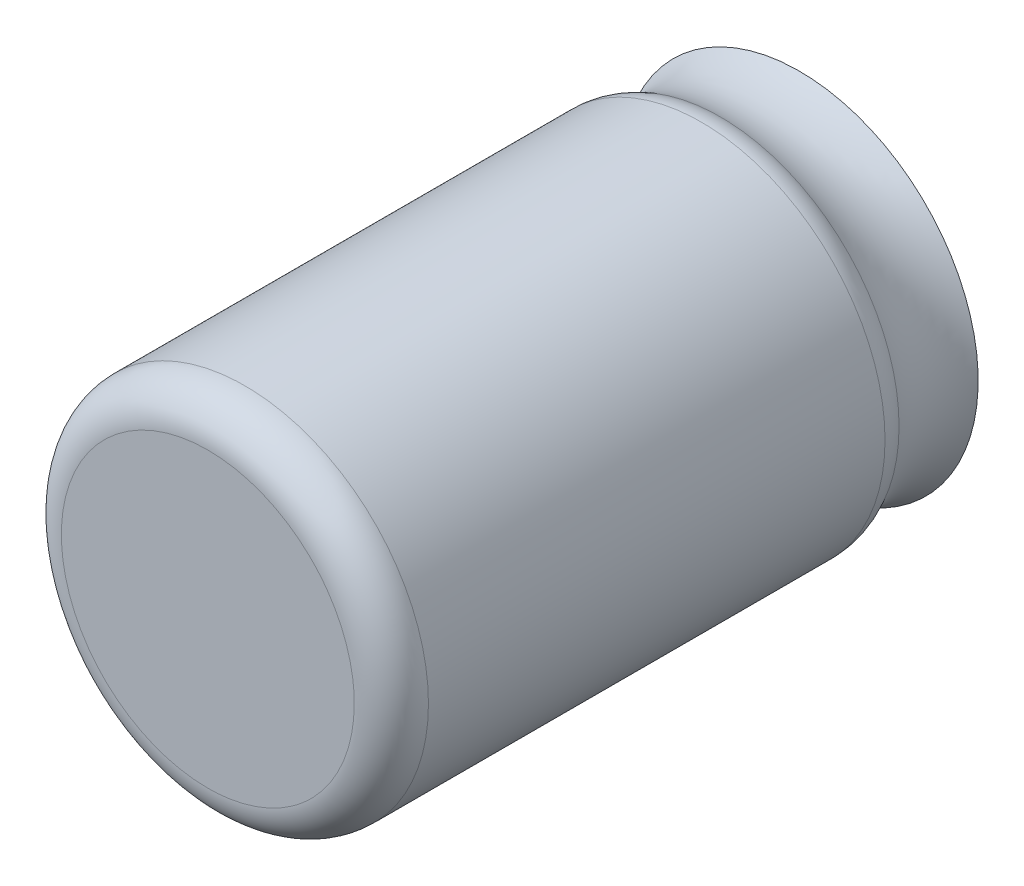
ISO-10303-21;
HEADER;
FILE_DESCRIPTION(('STEP AP214'),'2;1');
FILE_NAME('part.step','',(''),(''),'','','');
FILE_SCHEMA(('AUTOMOTIVE_DESIGN { 1 0 10303 214 1 1 1 1 }'));
ENDSEC;
DATA;
#1=APPLICATION_CONTEXT('core data for automotive mechanical design processes');
#2=APPLICATION_PROTOCOL_DEFINITION('international standard','automotive_design',2000,#1);
#3=PRODUCT_CONTEXT('',#1,'mechanical');
#4=PRODUCT('Part','Part','',(#3));
#5=PRODUCT_RELATED_PRODUCT_CATEGORY('part','',(#4));
#6=PRODUCT_DEFINITION_FORMATION('','',#4);
#7=PRODUCT_DEFINITION_CONTEXT('part definition',#1,'design');
#8=PRODUCT_DEFINITION('design','',#6,#7);
#9=PRODUCT_DEFINITION_SHAPE('','',#8);
#10=(LENGTH_UNIT() NAMED_UNIT(*) SI_UNIT(.MILLI.,.METRE.));
#11=(NAMED_UNIT(*) PLANE_ANGLE_UNIT() SI_UNIT($,.RADIAN.));
#12=(NAMED_UNIT(*) SI_UNIT($,.STERADIAN.) SOLID_ANGLE_UNIT());
#13=UNCERTAINTY_MEASURE_WITH_UNIT(LENGTH_MEASURE(1.E-05),#10,'distance_accuracy_value','');
#14=(GEOMETRIC_REPRESENTATION_CONTEXT(3) GLOBAL_UNCERTAINTY_ASSIGNED_CONTEXT((#13)) GLOBAL_UNIT_ASSIGNED_CONTEXT((#10,
#11,#12)) REPRESENTATION_CONTEXT('',''));
#15=CARTESIAN_POINT('',(0.,0.,0.));
#16=DIRECTION('',(0.,0.,1.));
#17=DIRECTION('',(1.,0.,0.));
#18=AXIS2_PLACEMENT_3D('',#15,#16,#17);
#19=CARTESIAN_POINT('',(-75.418194168406,-39.6644186635387,-2.6804035068493));
#20=DIRECTION('',(0.,0.,-1.));
#21=DIRECTION('',(-1.,0.,0.));
#22=AXIS2_PLACEMENT_3D('',#19,#20,#21);
#23=PLANE('',#22);
#24=CARTESIAN_POINT('',(-75.418194168406,-39.6644186635387,-2.68040350684929));
#25=DIRECTION('',(0.,0.,-1.));
#26=DIRECTION('',(-1.,0.,0.));
#27=AXIS2_PLACEMENT_3D('',#24,#25,#26);
#28=CIRCLE('',#27,1.8300230020711);
#29=CARTESIAN_POINT('',(-77.2482171704771,-39.6644186635387,-2.68040350684929));
#30=VERTEX_POINT('',#29);
#31=EDGE_CURVE('E25',#30,#30,#28,.T.);
#32=ORIENTED_EDGE('',*,*,#31,.T.);
#33=EDGE_LOOP('',(#32));
#34=FACE_BOUND('',#33,.T.);
#35=ADVANCED_FACE('F21',(#34),#23,.T.);
#36=CARTESIAN_POINT('',(-75.418194168406,-39.6644186635387,-2.2752975127846));
#37=DIRECTION('',(0.,0.,-1.));
#38=DIRECTION('',(-1.,0.,0.));
#39=AXIS2_PLACEMENT_3D('',#36,#37,#38);
#40=TOROIDAL_SURFACE('',#39,2.56241380282624,0.836963052624129);
#41=ORIENTED_EDGE('',*,*,#31,.F.);
#42=EDGE_LOOP('',(#41));
#43=FACE_BOUND('',#42,.T.);
#44=CARTESIAN_POINT('',(-75.418194168406,-39.6644186635387,-1.87019151871989));
#45=DIRECTION('',(0.,0.,1.));
#46=DIRECTION('',(1.,0.,0.));
#47=AXIS2_PLACEMENT_3D('',#44,#45,#46);
#48=CIRCLE('',#47,1.8300230020711);
#49=CARTESIAN_POINT('',(-73.5881711663349,-39.6644186635387,-1.87019151871989));
#50=VERTEX_POINT('',#49);
#51=EDGE_CURVE('E49',#50,#50,#48,.T.);
#52=ORIENTED_EDGE('',*,*,#51,.F.);
#53=EDGE_LOOP('',(#52));
#54=FACE_BOUND('',#53,.T.);
#55=ADVANCED_FACE('F69',(#43,#54),#40,.F.);
#56=CARTESIAN_POINT('',(-74.668194168406,-39.6644186635387,3.38000000000001));
#57=DIRECTION('',(0.,0.,1.));
#58=DIRECTION('',(1.,0.,0.));
#59=AXIS2_PLACEMENT_3D('',#56,#57,#58);
#60=PLANE('',#59);
#61=CARTESIAN_POINT('',(-75.418194168406,-39.6644186635387,3.38000000000002));
#62=DIRECTION('',(0.,0.,-1.));
#63=DIRECTION('',(0.,1.,0.));
#64=AXIS2_PLACEMENT_3D('',#61,#62,#63);
#65=CIRCLE('',#64,1.5);
#66=CARTESIAN_POINT('',(-75.418194168406,-41.1644186635387,3.38000000000001));
#67=VERTEX_POINT('',#66);
#68=CARTESIAN_POINT('',(-75.418194168406,-38.1644186635387,3.38000000000001));
#69=VERTEX_POINT('',#68);
#70=EDGE_CURVE('E46',#67,#69,#65,.T.);
#71=ORIENTED_EDGE('',*,*,#70,.F.);
#72=CARTESIAN_POINT('',(-73.918194168406,-39.6644186635387,3.38));
#73=CARTESIAN_POINT('',(-73.918194065496,-39.6807811285408,3.38));
#74=CARTESIAN_POINT('',(-73.9184618948795,-39.6971435877078,3.38));
#75=CARTESIAN_POINT('',(-73.9195326795034,-39.729850987835,3.38));
#76=CARTESIAN_POINT('',(-73.920335634744,-39.7461959287952,3.38));
#77=CARTESIAN_POINT('',(-73.9224759323522,-39.7788507859726,3.38));
#78=CARTESIAN_POINT('',(-73.9238132747199,-39.7951607021898,3.38));
#79=CARTESIAN_POINT('',(-73.9270208820755,-39.8277280458763,3.38));
#80=CARTESIAN_POINT('',(-73.9288911470634,-39.8439854733458,3.38));
#81=CARTESIAN_POINT('',(-73.9331626056271,-39.8764304303918,3.38));
#82=CARTESIAN_POINT('',(-73.9355637992029,-39.8926179599684,3.38));
#83=CARTESIAN_POINT('',(-73.9408945413545,-39.9249057872928,3.38));
#84=CARTESIAN_POINT('',(-73.9438240899302,-39.9410060850407,3.38));
#85=CARTESIAN_POINT('',(-73.9502084056721,-39.9731022080851,3.38));
#86=CARTESIAN_POINT('',(-73.9536631728381,-39.9890980333817,3.38));
#87=CARTESIAN_POINT('',(-73.9610942261419,-40.0209680827988,3.38));
#88=CARTESIAN_POINT('',(-73.9650705122797,-40.0368423069192,3.38));
#89=CARTESIAN_POINT('',(-73.9735403456651,-40.0684521554657,3.38));
#90=CARTESIAN_POINT('',(-73.9780338929127,-40.0841877798918,3.38));
#91=CARTESIAN_POINT('',(-73.9875334367027,-40.115503578949,3.38));
#92=CARTESIAN_POINT('',(-73.9925394332451,-40.1310837535803,3.38));
#93=CARTESIAN_POINT('',(-74.0030585150816,-40.1620719694066,3.38));
#94=CARTESIAN_POINT('',(-74.0085716003755,-40.1774800106017,3.38));
#95=CARTESIAN_POINT('',(-74.0200989561645,-40.2081074602394,3.38));
#96=CARTESIAN_POINT('',(-74.0261132266594,-40.2233268686819,3.38));
#97=CARTESIAN_POINT('',(-74.0386365126187,-40.2535607554908,3.38));
#98=CARTESIAN_POINT('',(-74.045145528083,-40.2685752338573,3.38));
#99=CARTESIAN_POINT('',(-74.0586513339655,-40.2983831826333,3.38));
#100=CARTESIAN_POINT('',(-74.0656481243836,-40.3131766530429,3.38));
#101=CARTESIAN_POINT('',(-74.0801219878304,-40.3425267446915,3.38));
#102=CARTESIAN_POINT('',(-74.0875990608591,-40.3570833659306,3.38));
#103=CARTESIAN_POINT('',(-74.1030254829079,-40.3859441716248,3.38));
#104=CARTESIAN_POINT('',(-74.110974831928,-40.4002483560799,3.38));
#105=CARTESIAN_POINT('',(-74.1273372935307,-40.4285889709975,3.38));
#106=CARTESIAN_POINT('',(-74.1357504061133,-40.4426254014601,3.38000000000001));
#107=CARTESIAN_POINT('',(-74.153031386119,-40.4704154775684,3.38));
#108=CARTESIAN_POINT('',(-74.1618992535423,-40.484169123214,3.38));
#109=CARTESIAN_POINT('',(-74.1800802463622,-40.5113789029222,3.38000000000001));
#110=CARTESIAN_POINT('',(-74.1893933717588,-40.5248350369848,3.38000000000002));
#111=CARTESIAN_POINT('',(-74.2084549112784,-40.551435380696,3.37999999999999));
#112=CARTESIAN_POINT('',(-74.2182033254013,-40.5645795903447,3.37999999999995));
#113=CARTESIAN_POINT('',(-74.238124990537,-40.5905420237589,3.38000000000006));
#114=CARTESIAN_POINT('',(-74.2482982415499,-40.6033602475244,3.38000000000022));
#115=CARTESIAN_POINT('',(-74.269058735174,-40.6286569320439,3.37999999999979));
#116=CARTESIAN_POINT('',(-74.2796459777852,-40.6411353927978,3.3799999999992));
#117=CARTESIAN_POINT('',(-74.3012229365899,-40.6657393795798,3.38000000000081));
#118=CARTESIAN_POINT('',(-74.3122126527833,-40.6778649056079,3.38000000000302));
#119=CARTESIAN_POINT('',(-74.3345834659352,-40.7017493275381,3.37999999999699));
#120=CARTESIAN_POINT('',(-74.3459645628936,-40.7135082234402,3.37999999998876));
#121=CARTESIAN_POINT('',(-74.3695779659328,-40.737124031094,3.38000000001171));
#122=CARTESIAN_POINT('',(-74.3818260386218,-40.7489651806533,3.38000000004452));
#123=CARTESIAN_POINT('',(-74.4067137709188,-40.7722286534488,3.37999999973177));
#124=CARTESIAN_POINT('',(-74.4193534330077,-40.7836509740304,3.3799999993862));
#125=CARTESIAN_POINT('',(-74.4450109323192,-40.8060631826469,3.37999999703423));
#126=CARTESIAN_POINT('',(-74.4580287766321,-40.8170530625651,3.37999999502778));
#127=CARTESIAN_POINT('',(-74.4844276600274,-40.8385884643466,3.37999998685059));
#128=CARTESIAN_POINT('',(-74.4978087104226,-40.8491339723428,3.3799999806797));
#129=CARTESIAN_POINT('',(-74.5249196700547,-40.8697677805995,3.37999996204697));
#130=CARTESIAN_POINT('',(-74.538649594478,-40.8798560609035,3.37999994958484));
#131=CARTESIAN_POINT('',(-74.5664405606113,-40.8995675079506,3.37999991058759));
#132=CARTESIAN_POINT('',(-74.5805016208288,-40.9091906486041,3.37999988405167));
#133=CARTESIAN_POINT('',(-74.6089234306006,-40.9279319955079,3.37999982605187));
#134=CARTESIAN_POINT('',(-74.6232836492174,-40.9370510061965,3.37999979459615));
#135=CARTESIAN_POINT('',(-74.6523171869455,-40.9547767953604,3.37999975270658));
#136=CARTESIAN_POINT('',(-74.666990511473,-40.9633835649649,3.37999974227309));
#137=CARTESIAN_POINT('',(-74.6966291293439,-40.9800782213099,3.37999974285231));
#138=CARTESIAN_POINT('',(-74.7115944173262,-40.9881661175665,3.37999975386463));
#139=CARTESIAN_POINT('',(-74.7417996526689,-41.0038090499719,3.37999979371001));
#140=CARTESIAN_POINT('',(-74.7570395851537,-41.0113641148723,3.37999982254211));
#141=CARTESIAN_POINT('',(-74.787770665378,-41.0259426490762,3.37999988794702));
#142=CARTESIAN_POINT('',(-74.8032617904713,-41.0329661659815,3.37999992451915));
#143=CARTESIAN_POINT('',(-74.8344903429067,-41.0464334854396,3.37999997697504));
#144=CARTESIAN_POINT('',(-74.8502277391382,-41.0528773605337,3.3799999928614));
#145=CARTESIAN_POINT('',(-74.887269882802,-41.0674461102474,3.38000000957166));
#146=CARTESIAN_POINT('',(-74.9086440159738,-41.0753953673804,3.38000000341641));
#147=CARTESIAN_POINT('',(-74.9534135551459,-41.0908679983234,3.37999999473278));
#148=CARTESIAN_POINT('',(-74.9768371392982,-41.0983105028258,3.37999999252277));
#149=CARTESIAN_POINT('',(-75.017598719616,-41.1101765086587,3.37999998022197));
#150=CARTESIAN_POINT('',(-75.0348587937245,-41.1148705167783,3.37999997243858));
#151=CARTESIAN_POINT('',(-75.0673633131179,-41.1230813228699,3.37999995862241));
#152=CARTESIAN_POINT('',(-75.0825890686287,-41.126671928964,3.37999995249251));
#153=CARTESIAN_POINT('',(-75.1109550483687,-41.1328880883913,3.37999994408227));
#154=CARTESIAN_POINT('',(-75.1240811867006,-41.1355781930741,3.37999994137591));
#155=CARTESIAN_POINT('',(-75.1526645795745,-41.1410320574925,3.37999993890244));
#156=CARTESIAN_POINT('',(-75.1681346437672,-41.1437289725687,3.37999993972063));
#157=CARTESIAN_POINT('',(-75.1991520380212,-41.1486322421413,3.37999994330224));
#158=CARTESIAN_POINT('',(-75.2146993673689,-41.150838601159,3.37999994606564));
#159=CARTESIAN_POINT('',(-75.2458558991112,-41.1547574884127,3.37999995360546));
#160=CARTESIAN_POINT('',(-75.261465100387,-41.1564700255365,3.37999995838183));
#161=CARTESIAN_POINT('',(-75.2927294786159,-41.1593998416431,3.37999996876695));
#162=CARTESIAN_POINT('',(-75.3083846543264,-41.1606171338884,3.37999997437567));
#163=CARTESIAN_POINT('',(-75.3397251561857,-41.1625551541124,3.37999998501965));
#164=CARTESIAN_POINT('',(-75.3554104812423,-41.1632758997493,3.37999999005494));
#165=CARTESIAN_POINT('',(-75.3867953925367,-41.1642202527432,3.37999999750468));
#166=CARTESIAN_POINT('',(-75.4024949781111,-41.1644438821455,3.37999999991924));
#167=CARTESIAN_POINT('',(-75.418194168406,-41.1644186635387,3.38));
#168=B_SPLINE_CURVE_WITH_KNOTS('',3,(#72,#73,#74,#75,#76,#77,#78,#79,#80,#81,#82,#83,#84,#85,
#86,#87,#88,#89,#90,#91,#92,#93,#94,#95,#96,#97,#98,#99,#100,#101,#102,#103,#104,#105,#106,#107,
#108,#109,#110,#111,#112,#113,#114,#115,#116,#117,#118,#119,#120,#121,#122,#123,#124,#125,#126,
#127,#128,#129,#130,#131,#132,#133,#134,#135,#136,#137,#138,#139,#140,#141,#142,#143,#144,#145,
#146,#147,#148,#149,#150,#151,#152,#153,#154,#155,#156,#157,#158,#159,#160,#161,#162,#163,#164,
#165,#166,#167),.UNSPECIFIED.,.F.,.F.,(4,2,2,2,2,2,2,2,2,2,2,2,2,2,2,2,2,2,2,2,2,2,2,2,2,2,2,2,
2,2,2,2,2,2,2,2,2,2,2,2,2,2,2,2,2,2,2,4),(0.,0.0490851948794626,0.0981703897589252,
0.147255584638387,0.196340779517847,0.245425974397309,0.294511169276766,0.343596364156229,
0.39268155903569,0.441766753915151,0.490851948794609,0.539937143674074,0.589022338553537,
0.638107533432993,0.687192728312457,0.736277923191917,0.785363118071376,0.834448312950835,
0.883533507830304,0.932618702709755,0.98170389758922,1.03078909246868,1.07987428734814,
1.1289594822276,1.17804467710706,1.22914316595257,1.28024197860535,1.3313417498941,
1.38244311463509,1.4335467076317,1.48465316367371,1.53567556451201,1.58669884868091,
1.63772119683376,1.68874078973042,1.73975580824955,1.7907644334015,1.85915831381125,
1.9328575909729,1.98650810163932,2.03343009148699,2.07362232976818,2.12072429460252,
2.16782582530495,2.21492650823673,2.26202592976362,2.30912367625607,2.35621933408942),.UNSPECIFIED.);
#169=CARTESIAN_POINT('',(-73.918194168406,-39.6644187822155,3.38));
#170=VERTEX_POINT('',#169);
#171=EDGE_CURVE('E44',#170,#67,#168,.T.);
#172=ORIENTED_EDGE('',*,*,#171,.F.);
#173=CARTESIAN_POINT('',(-75.418194168406,-38.1644186635387,3.38));
#174=CARTESIAN_POINT('',(-75.4018317034039,-38.1644185606287,3.38));
#175=CARTESIAN_POINT('',(-75.3854692442369,-38.1646863900121,3.38));
#176=CARTESIAN_POINT('',(-75.3527618441098,-38.1657571746361,3.38));
#177=CARTESIAN_POINT('',(-75.3364169031495,-38.1665601298767,3.38));
#178=CARTESIAN_POINT('',(-75.3037620459721,-38.1687004274849,3.38));
#179=CARTESIAN_POINT('',(-75.287452129755,-38.1700377698526,3.38));
#180=CARTESIAN_POINT('',(-75.2548847860684,-38.1732453772082,3.38));
#181=CARTESIAN_POINT('',(-75.2386273585989,-38.1751156421961,3.38));
#182=CARTESIAN_POINT('',(-75.2061824015529,-38.1793871007598,3.38));
#183=CARTESIAN_POINT('',(-75.1899948719764,-38.1817882943356,3.38));
#184=CARTESIAN_POINT('',(-75.1577070446519,-38.1871190364872,3.38));
#185=CARTESIAN_POINT('',(-75.141606746904,-38.1900485850629,3.38));
#186=CARTESIAN_POINT('',(-75.1095106238596,-38.1964329008048,3.38));
#187=CARTESIAN_POINT('',(-75.093514798563,-38.1998876679708,3.38));
#188=CARTESIAN_POINT('',(-75.0616447491459,-38.2073187212746,3.38));
#189=CARTESIAN_POINT('',(-75.0457705250255,-38.2112950074124,3.38));
#190=CARTESIAN_POINT('',(-75.014160676479,-38.2197648407978,3.38));
#191=CARTESIAN_POINT('',(-74.998425052053,-38.2242583880454,3.38));
#192=CARTESIAN_POINT('',(-74.9671092529957,-38.2337579318354,3.38));
#193=CARTESIAN_POINT('',(-74.9515290783645,-38.2387639283778,3.38));
#194=CARTESIAN_POINT('',(-74.9205408625381,-38.2492830102142,3.38));
#195=CARTESIAN_POINT('',(-74.905132821343,-38.2547960955082,3.38));
#196=CARTESIAN_POINT('',(-74.8745053717054,-38.2663234512972,3.38));
#197=CARTESIAN_POINT('',(-74.8592859632629,-38.2723377217921,3.38));
#198=CARTESIAN_POINT('',(-74.8290520764539,-38.2848610077514,3.38));
#199=CARTESIAN_POINT('',(-74.8140375980874,-38.2913700232157,3.38));
#200=CARTESIAN_POINT('',(-74.7842296493114,-38.3048758290981,3.38));
#201=CARTESIAN_POINT('',(-74.7694361789018,-38.3118726195163,3.38));
#202=CARTESIAN_POINT('',(-74.7400860872532,-38.3263464829631,3.38));
#203=CARTESIAN_POINT('',(-74.7255294660141,-38.3338235559917,3.38));
#204=CARTESIAN_POINT('',(-74.6966686603199,-38.3492499780406,3.38));
#205=CARTESIAN_POINT('',(-74.6823644758649,-38.3571993270607,3.38));
#206=CARTESIAN_POINT('',(-74.6540238609472,-38.3735617886634,3.38));
#207=CARTESIAN_POINT('',(-74.6399874304846,-38.3819749012459,3.38000000000001));
#208=CARTESIAN_POINT('',(-74.6121973543763,-38.3992558812517,3.38));
#209=CARTESIAN_POINT('',(-74.5984437087307,-38.4081237486749,3.38));
#210=CARTESIAN_POINT('',(-74.5712339290225,-38.4263047414948,3.38000000000001));
#211=CARTESIAN_POINT('',(-74.5577777949599,-38.4356178668915,3.38000000000002));
#212=CARTESIAN_POINT('',(-74.5311774512487,-38.4546794064111,3.37999999999999));
#213=CARTESIAN_POINT('',(-74.5180332416,-38.464427820534,3.37999999999995));
#214=CARTESIAN_POINT('',(-74.4920708081858,-38.4843494856697,3.38000000000006));
#215=CARTESIAN_POINT('',(-74.4792525844203,-38.4945227366825,3.38000000000022));
#216=CARTESIAN_POINT('',(-74.4539558999008,-38.5152832303066,3.37999999999979));
#217=CARTESIAN_POINT('',(-74.4414774391469,-38.5258704729179,3.3799999999992));
#218=CARTESIAN_POINT('',(-74.4168734523649,-38.5474474317226,3.38000000000081));
#219=CARTESIAN_POINT('',(-74.4047479263368,-38.558437147916,3.38000000000302));
#220=CARTESIAN_POINT('',(-74.3808635044066,-38.5808079610678,3.37999999999699));
#221=CARTESIAN_POINT('',(-74.3691046085045,-38.5921890580262,3.37999999998876));
#222=CARTESIAN_POINT('',(-74.3454888008512,-38.615802461065,3.38000000001171));
#223=CARTESIAN_POINT('',(-74.3336476512924,-38.6280505337535,3.38000000004452));
#224=CARTESIAN_POINT('',(-74.3103841784978,-38.6529382660495,3.37999999973177));
#225=CARTESIAN_POINT('',(-74.2989618579167,-38.6655779281379,3.3799999993862));
#226=CARTESIAN_POINT('',(-74.2765496493012,-38.6912354274484,3.37999999703423));
#227=CARTESIAN_POINT('',(-74.2655597693834,-38.7042532717608,3.37999999502778));
#228=CARTESIAN_POINT('',(-74.2440243676028,-38.730652155155,3.37999998685059));
#229=CARTESIAN_POINT('',(-74.2334788596071,-38.7440332055497,3.3799999806797));
#230=CARTESIAN_POINT('',(-74.2128450513513,-38.7711441651808,3.37999996204697));
#231=CARTESIAN_POINT('',(-74.2027567710477,-38.7848740896036,3.37999994958484));
#232=CARTESIAN_POINT('',(-74.1830453240016,-38.8126650557358,3.37999991058759));
#233=CARTESIAN_POINT('',(-74.1734221833484,-38.8267261159527,3.37999988405167));
#234=CARTESIAN_POINT('',(-74.1546808364448,-38.8551479257246,3.37999982605187));
#235=CARTESIAN_POINT('',(-74.1455618257558,-38.8695081443419,3.37999979459615));
#236=CARTESIAN_POINT('',(-74.1278360365912,-38.8985416820711,3.37999975270658));
#237=CARTESIAN_POINT('',(-74.1192292669864,-38.9132150065991,3.37999974227309));
#238=CARTESIAN_POINT('',(-74.1025346106405,-38.9428536244711,3.37999974285231));
#239=CARTESIAN_POINT('',(-74.0944467143836,-38.9578189124539,3.37999975386463));
#240=CARTESIAN_POINT('',(-74.0788037819772,-38.9880241477976,3.37999979371001));
#241=CARTESIAN_POINT('',(-74.0712487170763,-39.0032640802829,3.37999982254211));
#242=CARTESIAN_POINT('',(-74.0566701828715,-39.0339951605083,3.37999988794703));
#243=CARTESIAN_POINT('',(-74.0496466659659,-39.0494862856021,3.37999992451915));
#244=CARTESIAN_POINT('',(-74.0361793465061,-39.0807148380383,3.37999997697504));
#245=CARTESIAN_POINT('',(-74.0297354714107,-39.09645223427,3.3799999928614));
#246=CARTESIAN_POINT('',(-74.0151667215804,-39.1334943782343,3.38000000957166));
#247=CARTESIAN_POINT('',(-74.0072174643446,-39.1548685117113,3.38000000341641));
#248=CARTESIAN_POINT('',(-73.9917448334309,-39.199638050891,3.37999999473278));
#249=CARTESIAN_POINT('',(-73.9843023290308,-39.2230616347352,3.37999999252277));
#250=CARTESIAN_POINT('',(-73.972436323656,-39.2638232134629,3.37999998022197));
#251=CARTESIAN_POINT('',(-73.9677423158614,-39.2810832862806,3.37999997243858));
#252=CARTESIAN_POINT('',(-73.9595315100082,-39.3135878043619,3.37999995862241));
#253=CARTESIAN_POINT('',(-73.9559409038738,-39.3288135598629,3.37999995249251));
#254=CARTESIAN_POINT('',(-73.9497247440867,-39.357179540885,3.37999994408227));
#255=CARTESIAN_POINT('',(-73.9470346391197,-39.3703056805164,3.37999994137591));
#256=CARTESIAN_POINT('',(-73.9415807744522,-39.3988890746973,3.37999993890244));
#257=CARTESIAN_POINT('',(-73.9388838593754,-39.4143591388904,3.37999993972063));
#258=CARTESIAN_POINT('',(-73.9339805898021,-39.4453765331454,3.37999994330224));
#259=CARTESIAN_POINT('',(-73.9317742307844,-39.4609238624938,3.37999994606564));
#260=CARTESIAN_POINT('',(-73.9278553435305,-39.4920803942373,3.37999995360546));
#261=CARTESIAN_POINT('',(-73.9261428064066,-39.5076895955137,3.37999995838183));
#262=CARTESIAN_POINT('',(-73.9232129902999,-39.5389539737438,3.37999996876695));
#263=CARTESIAN_POINT('',(-73.9219956980547,-39.554609149455,3.37999997437567));
#264=CARTESIAN_POINT('',(-73.920057677831,-39.5859496513154,3.37999998501965));
#265=CARTESIAN_POINT('',(-73.9193369321942,-39.6016349763726,3.37999999005494));
#266=CARTESIAN_POINT('',(-73.9183925792008,-39.6330198876682,3.37999999750468));
#267=CARTESIAN_POINT('',(-73.9181689497988,-39.6487194732432,3.37999999991924));
#268=CARTESIAN_POINT('',(-73.918194168406,-39.6644186635387,3.38));
#269=B_SPLINE_CURVE_WITH_KNOTS('',3,(#173,#174,#175,#176,#177,#178,#179,#180,#181,#182,#183,
#184,#185,#186,#187,#188,#189,#190,#191,#192,#193,#194,#195,#196,#197,#198,#199,#200,#201,#202,
#203,#204,#205,#206,#207,#208,#209,#210,#211,#212,#213,#214,#215,#216,#217,#218,#219,#220,#221,
#222,#223,#224,#225,#226,#227,#228,#229,#230,#231,#232,#233,#234,#235,#236,#237,#238,#239,#240,
#241,#242,#243,#244,#245,#246,#247,#248,#249,#250,#251,#252,#253,#254,#255,#256,#257,#258,#259,
#260,#261,#262,#263,#264,#265,#266,#267,#268),.UNSPECIFIED.,.F.,.F.,(4,2,2,2,2,2,2,2,2,2,2,2,2,
2,2,2,2,2,2,2,2,2,2,2,2,2,2,2,2,2,2,2,2,2,2,2,2,2,2,2,2,2,2,2,2,2,2,4),(0.,0.0490851948794558,
0.0981703897589249,0.147255584638379,0.196340779517834,0.245425974397301,0.294511169276759,
0.343596364156224,0.392681559035676,0.441766753915137,0.490851948794593,0.53993714367406,
0.589022338553514,0.638107533432983,0.687192728312438,0.736277923191897,0.785363118071354,
0.834448312950813,0.883533507830268,0.932618702709733,0.981703897589194,1.03078909246865,
1.07987428734811,1.12895948222757,1.17804467710703,1.22914316595049,1.28024197860122,
1.33134174988788,1.38244311462681,1.43354670762135,1.48465316366126,1.53567556450152,
1.58669884867237,1.63772119682719,1.68874078972583,1.73975580824698,1.79076443340099,
1.85915831477552,1.93285759096464,1.98650809764099,2.03343008748777,2.07362232975779,
2.12072429459395,2.1678258252982,2.21492650823179,2.26202592976049,2.30912367625472,
2.35621933408981),.UNSPECIFIED.);
#270=EDGE_CURVE('E39',#69,#170,#269,.T.);
#271=ORIENTED_EDGE('',*,*,#270,.F.);
#272=EDGE_LOOP('',(#71,#172,#271));
#273=FACE_BOUND('',#272,.T.);
#274=ADVANCED_FACE('F45',(#273),#60,.T.);
#275=CARTESIAN_POINT('',(-75.418194168406,-39.6644186635387,-1.67658393100415));
#276=DIRECTION('',(0.,0.,-1.));
#277=DIRECTION('',(-1.,0.,0.));
#278=AXIS2_PLACEMENT_3D('',#275,#276,#277);
#279=TOROIDAL_SURFACE('',#278,1.48000000000051,0.399999999999527);
#280=ORIENTED_EDGE('',*,*,#51,.T.);
#281=EDGE_LOOP('',(#280));
#282=FACE_BOUND('',#281,.T.);
#283=CARTESIAN_POINT('',(-75.418194168406,-39.6644186635387,-1.67658393100403));
#284=DIRECTION('',(0.,0.,1.));
#285=DIRECTION('',(1.,0.,0.));
#286=AXIS2_PLACEMENT_3D('',#283,#284,#285);
#287=CIRCLE('',#286,1.88000000000003);
#288=CARTESIAN_POINT('',(-73.538194168406,-39.6644186635387,-1.67658393100403));
#289=VERTEX_POINT('',#288);
#290=EDGE_CURVE('E31',#289,#289,#287,.T.);
#291=ORIENTED_EDGE('',*,*,#290,.F.);
#292=EDGE_LOOP('',(#291));
#293=FACE_BOUND('',#292,.T.);
#294=ADVANCED_FACE('F64',(#282,#293),#279,.T.);
#295=CARTESIAN_POINT('',(-75.418194168406,-39.6644186635387,3.00000000000003));
#296=DIRECTION('',(0.,0.,-1.));
#297=DIRECTION('',(0.,1.,0.));
#298=AXIS2_PLACEMENT_3D('',#295,#296,#297);
#299=TOROIDAL_SURFACE('',#298,1.50000000000003,0.379999999999987);
#300=ORIENTED_EDGE('',*,*,#171,.T.);
#301=ORIENTED_EDGE('',*,*,#70,.T.);
#302=ORIENTED_EDGE('',*,*,#270,.T.);
#303=EDGE_LOOP('',(#300,#301,#302));
#304=FACE_BOUND('',#303,.T.);
#305=CARTESIAN_POINT('',(-75.418194168406,-39.6644186635387,3.00000000000001));
#306=DIRECTION('',(0.,0.,1.));
#307=DIRECTION('',(1.,0.,0.));
#308=AXIS2_PLACEMENT_3D('',#305,#306,#307);
#309=CIRCLE('',#308,1.88000000000003);
#310=CARTESIAN_POINT('',(-73.538194168406,-39.6644186635387,3.00000000000001));
#311=VERTEX_POINT('',#310);
#312=EDGE_CURVE('E12',#311,#311,#309,.F.);
#313=ORIENTED_EDGE('',*,*,#312,.F.);
#314=EDGE_LOOP('',(#313));
#315=FACE_BOUND('',#314,.T.);
#316=ADVANCED_FACE('F23',(#304,#315),#299,.T.);
#317=CARTESIAN_POINT('',(-75.418194168406,-39.6644186635387,0.584683614855518));
#318=DIRECTION('',(0.,0.,1.));
#319=DIRECTION('',(1.,0.,0.));
#320=AXIS2_PLACEMENT_3D('',#317,#318,#319);
#321=CYLINDRICAL_SURFACE('',#320,1.88000000000003);
#322=ORIENTED_EDGE('',*,*,#290,.T.);
#323=EDGE_LOOP('',(#322));
#324=FACE_BOUND('',#323,.T.);
#325=ORIENTED_EDGE('',*,*,#312,.T.);
#326=EDGE_LOOP('',(#325));
#327=FACE_BOUND('',#326,.T.);
#328=ADVANCED_FACE('F78',(#324,#327),#321,.T.);
#329=CLOSED_SHELL('',(#35,#55,#274,#294,#316,#328));
#330=MANIFOLD_SOLID_BREP('B1',#329);
#331=ADVANCED_BREP_SHAPE_REPRESENTATION('',(#18,#330),#14);
#332=SHAPE_DEFINITION_REPRESENTATION(#9,#331);
ENDSEC;
END-ISO-10303-21;
